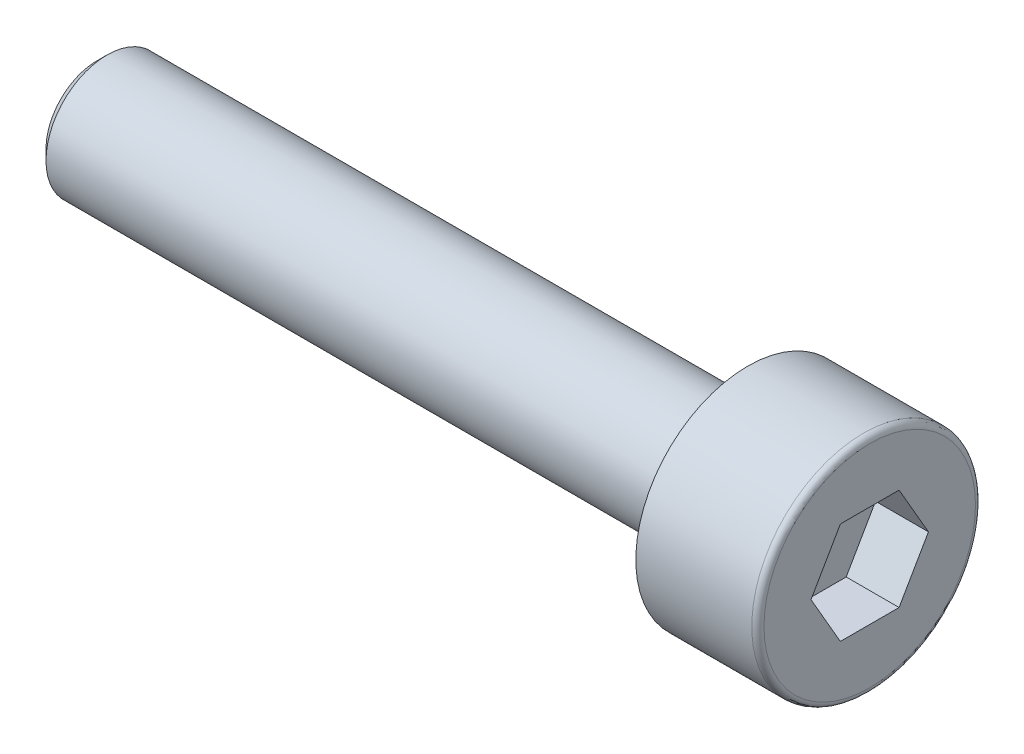
ISO-10303-21;
HEADER;
FILE_DESCRIPTION(('STEP AP214'),'2;1');
FILE_NAME('part.step','',(''),(''),'','','');
FILE_SCHEMA(('AUTOMOTIVE_DESIGN { 1 0 10303 214 1 1 1 1 }'));
ENDSEC;
DATA;
#1=APPLICATION_CONTEXT('core data for automotive mechanical design processes');
#2=APPLICATION_PROTOCOL_DEFINITION('international standard','automotive_design',2000,#1);
#3=PRODUCT_CONTEXT('',#1,'mechanical');
#4=PRODUCT('Part','Part','',(#3));
#5=PRODUCT_RELATED_PRODUCT_CATEGORY('part','',(#4));
#6=PRODUCT_DEFINITION_FORMATION('','',#4);
#7=PRODUCT_DEFINITION_CONTEXT('part definition',#1,'design');
#8=PRODUCT_DEFINITION('design','',#6,#7);
#9=PRODUCT_DEFINITION_SHAPE('','',#8);
#10=(LENGTH_UNIT() NAMED_UNIT(*) SI_UNIT(.MILLI.,.METRE.));
#11=(NAMED_UNIT(*) PLANE_ANGLE_UNIT() SI_UNIT($,.RADIAN.));
#12=(NAMED_UNIT(*) SI_UNIT($,.STERADIAN.) SOLID_ANGLE_UNIT());
#13=UNCERTAINTY_MEASURE_WITH_UNIT(LENGTH_MEASURE(1.E-05),#10,'distance_accuracy_value','');
#14=(GEOMETRIC_REPRESENTATION_CONTEXT(3) GLOBAL_UNCERTAINTY_ASSIGNED_CONTEXT((#13)) GLOBAL_UNIT_ASSIGNED_CONTEXT((#10,
#11,#12)) REPRESENTATION_CONTEXT('',''));
#15=CARTESIAN_POINT('',(0.,0.,0.));
#16=DIRECTION('',(0.,0.,1.));
#17=DIRECTION('',(1.,0.,0.));
#18=AXIS2_PLACEMENT_3D('',#15,#16,#17);
#19=CARTESIAN_POINT('',(0.,0.,0.));
#20=DIRECTION('',(1.,0.,0.));
#21=DIRECTION('',(0.,1.,0.));
#22=AXIS2_PLACEMENT_3D('',#19,#20,#21);
#23=PLANE('',#22);
#24=DIRECTION('',(0.,-0.866025403784439,0.5));
#25=VECTOR('',#24,1.);
#26=CARTESIAN_POINT('',(0.,1.25,0.721687836487035));
#27=LINE('',#26,#25);
#28=CARTESIAN_POINT('',(0.,1.25,0.721687836487035));
#29=VERTEX_POINT('',#28);
#30=CARTESIAN_POINT('',(0.,0.,1.44337567297407));
#31=VERTEX_POINT('',#30);
#32=EDGE_CURVE('E30',#29,#31,#27,.T.);
#33=ORIENTED_EDGE('',*,*,#32,.F.);
#34=DIRECTION('',(0.,0.,1.));
#35=VECTOR('',#34,1.);
#36=CARTESIAN_POINT('',(0.,1.25,-0.721687836487035));
#37=LINE('',#36,#35);
#38=CARTESIAN_POINT('',(0.,1.25,-0.721687836487035));
#39=VERTEX_POINT('',#38);
#40=EDGE_CURVE('E113',#39,#29,#37,.T.);
#41=ORIENTED_EDGE('',*,*,#40,.F.);
#42=DIRECTION('',(0.,0.866025403784439,0.5));
#43=VECTOR('',#42,1.);
#44=CARTESIAN_POINT('',(0.,0.,-1.44337567297406));
#45=LINE('',#44,#43);
#46=CARTESIAN_POINT('',(0.,0.,-1.44337567297406));
#47=VERTEX_POINT('',#46);
#48=EDGE_CURVE('E111',#47,#39,#45,.T.);
#49=ORIENTED_EDGE('',*,*,#48,.F.);
#50=DIRECTION('',(0.,0.866025403784439,-0.5));
#51=VECTOR('',#50,1.);
#52=CARTESIAN_POINT('',(0.,-1.25,-0.721687836487029));
#53=LINE('',#52,#51);
#54=CARTESIAN_POINT('',(0.,-1.25,-0.721687836487029));
#55=VERTEX_POINT('',#54);
#56=EDGE_CURVE('E78',#55,#47,#53,.T.);
#57=ORIENTED_EDGE('',*,*,#56,.F.);
#58=DIRECTION('',(0.,0.,-1.));
#59=VECTOR('',#58,1.);
#60=CARTESIAN_POINT('',(0.,-1.25,0.721687836487035));
#61=LINE('',#60,#59);
#62=CARTESIAN_POINT('',(0.,-1.25,0.721687836487035));
#63=VERTEX_POINT('',#62);
#64=EDGE_CURVE('E107',#63,#55,#61,.T.);
#65=ORIENTED_EDGE('',*,*,#64,.F.);
#66=DIRECTION('',(0.,-0.866025403784439,-0.5));
#67=VECTOR('',#66,1.);
#68=CARTESIAN_POINT('',(0.,0.,1.44337567297407));
#69=LINE('',#68,#67);
#70=EDGE_CURVE('E104',#31,#63,#69,.T.);
#71=ORIENTED_EDGE('',*,*,#70,.F.);
#72=EDGE_LOOP('',(#33,#41,#49,#57,#65,#71));
#73=FACE_BOUND('',#72,.T.);
#74=CARTESIAN_POINT('',(0.,0.,0.));
#75=DIRECTION('',(1.,0.,0.));
#76=DIRECTION('',(0.,1.,0.));
#77=AXIS2_PLACEMENT_3D('',#74,#75,#76);
#78=CIRCLE('',#77,2.6);
#79=CARTESIAN_POINT('',(0.,2.6,0.));
#80=VERTEX_POINT('',#79);
#81=EDGE_CURVE('E131',#80,#80,#78,.T.);
#82=ORIENTED_EDGE('',*,*,#81,.T.);
#83=EDGE_LOOP('',(#82));
#84=FACE_BOUND('',#83,.T.);
#85=ADVANCED_FACE('F15',(#73,#84),#23,.T.);
#86=CARTESIAN_POINT('',(-0.15,0.,0.));
#87=DIRECTION('',(1.,0.,0.));
#88=DIRECTION('',(0.,1.,0.));
#89=AXIS2_PLACEMENT_3D('',#86,#87,#88);
#90=TOROIDAL_SURFACE('',#89,2.6,0.15);
#91=CARTESIAN_POINT('',(-0.15,0.,0.));
#92=DIRECTION('',(1.,0.,0.));
#93=DIRECTION('',(0.,1.,0.));
#94=AXIS2_PLACEMENT_3D('',#91,#92,#93);
#95=CIRCLE('',#94,2.75);
#96=CARTESIAN_POINT('',(-0.15,2.75,0.));
#97=VERTEX_POINT('',#96);
#98=EDGE_CURVE('E128',#97,#97,#95,.T.);
#99=ORIENTED_EDGE('',*,*,#98,.T.);
#100=EDGE_LOOP('',(#99));
#101=FACE_BOUND('',#100,.T.);
#102=ORIENTED_EDGE('',*,*,#81,.F.);
#103=EDGE_LOOP('',(#102));
#104=FACE_BOUND('',#103,.T.);
#105=ADVANCED_FACE('F150',(#101,#104),#90,.T.);
#106=CARTESIAN_POINT('',(0.,0.,0.));
#107=DIRECTION('',(1.,0.,0.));
#108=DIRECTION('',(0.,1.,0.));
#109=AXIS2_PLACEMENT_3D('',#106,#107,#108);
#110=CYLINDRICAL_SURFACE('',#109,2.75);
#111=CARTESIAN_POINT('',(-3.,0.,0.));
#112=DIRECTION('',(1.,0.,0.));
#113=DIRECTION('',(0.,1.,0.));
#114=AXIS2_PLACEMENT_3D('',#111,#112,#113);
#115=CIRCLE('',#114,2.75);
#116=CARTESIAN_POINT('',(-3.,2.75,0.));
#117=VERTEX_POINT('',#116);
#118=EDGE_CURVE('E125',#117,#117,#115,.T.);
#119=ORIENTED_EDGE('',*,*,#118,.T.);
#120=EDGE_LOOP('',(#119));
#121=FACE_BOUND('',#120,.T.);
#122=ORIENTED_EDGE('',*,*,#98,.F.);
#123=EDGE_LOOP('',(#122));
#124=FACE_BOUND('',#123,.T.);
#125=ADVANCED_FACE('F156',(#121,#124),#110,.T.);
#126=CARTESIAN_POINT('',(-3.,2.75,0.));
#127=DIRECTION('',(-1.,0.,0.));
#128=DIRECTION('',(0.,-1.,0.));
#129=AXIS2_PLACEMENT_3D('',#126,#127,#128);
#130=PLANE('',#129);
#131=CARTESIAN_POINT('',(-3.,0.,0.));
#132=DIRECTION('',(1.,0.,0.));
#133=DIRECTION('',(0.,1.,0.));
#134=AXIS2_PLACEMENT_3D('',#131,#132,#133);
#135=CIRCLE('',#134,1.5);
#136=CARTESIAN_POINT('',(-3.,1.5,0.));
#137=VERTEX_POINT('',#136);
#138=EDGE_CURVE('E117',#137,#137,#135,.T.);
#139=ORIENTED_EDGE('',*,*,#138,.T.);
#140=EDGE_LOOP('',(#139));
#141=FACE_BOUND('',#140,.T.);
#142=ORIENTED_EDGE('',*,*,#118,.F.);
#143=EDGE_LOOP('',(#142));
#144=FACE_BOUND('',#143,.T.);
#145=ADVANCED_FACE('F163',(#141,#144),#130,.T.);
#146=CARTESIAN_POINT('',(0.,0.,0.));
#147=DIRECTION('',(1.,0.,0.));
#148=DIRECTION('',(0.,1.,0.));
#149=AXIS2_PLACEMENT_3D('',#146,#147,#148);
#150=CYLINDRICAL_SURFACE('',#149,1.5);
#151=CARTESIAN_POINT('',(-18.75,0.,0.));
#152=DIRECTION('',(-1.,0.,0.));
#153=DIRECTION('',(0.,-1.,0.));
#154=AXIS2_PLACEMENT_3D('',#151,#152,#153);
#155=CIRCLE('',#154,1.5);
#156=CARTESIAN_POINT('',(-18.75,-1.5,0.));
#157=VERTEX_POINT('',#156);
#158=EDGE_CURVE('E23',#157,#157,#155,.F.);
#159=ORIENTED_EDGE('',*,*,#158,.T.);
#160=EDGE_LOOP('',(#159));
#161=FACE_BOUND('',#160,.T.);
#162=ORIENTED_EDGE('',*,*,#138,.F.);
#163=EDGE_LOOP('',(#162));
#164=FACE_BOUND('',#163,.T.);
#165=ADVANCED_FACE('F136',(#161,#164),#150,.T.);
#166=CARTESIAN_POINT('',(-19.,1.5,0.));
#167=DIRECTION('',(-1.,0.,0.));
#168=DIRECTION('',(0.,-1.,0.));
#169=AXIS2_PLACEMENT_3D('',#166,#167,#168);
#170=PLANE('',#169);
#171=CARTESIAN_POINT('',(-19.,0.,0.));
#172=DIRECTION('',(-1.,0.,0.));
#173=DIRECTION('',(0.,-1.,0.));
#174=AXIS2_PLACEMENT_3D('',#171,#172,#173);
#175=CIRCLE('',#174,1.25);
#176=CARTESIAN_POINT('',(-19.,-1.25,0.));
#177=VERTEX_POINT('',#176);
#178=EDGE_CURVE('E9',#177,#177,#175,.T.);
#179=ORIENTED_EDGE('',*,*,#178,.T.);
#180=EDGE_LOOP('',(#179));
#181=FACE_BOUND('',#180,.T.);
#182=ADVANCED_FACE('F170',(#181),#170,.T.);
#183=CARTESIAN_POINT('',(-1.3,1.25,0.721687836487035));
#184=DIRECTION('',(0.,0.5,0.866025403784439));
#185=DIRECTION('',(0.,-0.866025403784439,0.5));
#186=AXIS2_PLACEMENT_3D('',#183,#184,#185);
#187=PLANE('',#186);
#188=ORIENTED_EDGE('',*,*,#32,.T.);
#189=DIRECTION('',(1.,0.,0.));
#190=VECTOR('',#189,1.);
#191=CARTESIAN_POINT('',(-1.3,0.,1.44337567297407));
#192=LINE('',#191,#190);
#193=CARTESIAN_POINT('',(-1.3,0.,1.44337567297407));
#194=VERTEX_POINT('',#193);
#195=EDGE_CURVE('E60',#194,#31,#192,.T.);
#196=ORIENTED_EDGE('',*,*,#195,.F.);
#197=DIRECTION('',(0.,-0.866025403784439,0.5));
#198=VECTOR('',#197,1.);
#199=CARTESIAN_POINT('',(-1.3,1.25,0.721687836487035));
#200=LINE('',#199,#198);
#201=CARTESIAN_POINT('',(-1.3,1.25,0.721687836487035));
#202=VERTEX_POINT('',#201);
#203=EDGE_CURVE('E115',#202,#194,#200,.T.);
#204=ORIENTED_EDGE('',*,*,#203,.F.);
#205=DIRECTION('',(1.,0.,0.));
#206=VECTOR('',#205,1.);
#207=CARTESIAN_POINT('',(-1.3,1.25,0.721687836487035));
#208=LINE('',#207,#206);
#209=EDGE_CURVE('E38',#202,#29,#208,.T.);
#210=ORIENTED_EDGE('',*,*,#209,.T.);
#211=EDGE_LOOP('',(#188,#196,#204,#210));
#212=FACE_BOUND('',#211,.T.);
#213=ADVANCED_FACE('F173',(#212),#187,.F.);
#214=CARTESIAN_POINT('',(-1.3,1.25,-0.721687836487035));
#215=DIRECTION('',(0.,1.,0.));
#216=DIRECTION('',(-1.,0.,0.));
#217=AXIS2_PLACEMENT_3D('',#214,#215,#216);
#218=PLANE('',#217);
#219=ORIENTED_EDGE('',*,*,#40,.T.);
#220=ORIENTED_EDGE('',*,*,#209,.F.);
#221=DIRECTION('',(0.,0.,1.));
#222=VECTOR('',#221,1.);
#223=CARTESIAN_POINT('',(-1.3,1.25,-0.721687836487035));
#224=LINE('',#223,#222);
#225=CARTESIAN_POINT('',(-1.3,1.25,-0.721687836487035));
#226=VERTEX_POINT('',#225);
#227=EDGE_CURVE('E90',#226,#202,#224,.T.);
#228=ORIENTED_EDGE('',*,*,#227,.F.);
#229=DIRECTION('',(1.,0.,0.));
#230=VECTOR('',#229,1.);
#231=CARTESIAN_POINT('',(-1.3,1.25,-0.721687836487035));
#232=LINE('',#231,#230);
#233=EDGE_CURVE('E82',#226,#39,#232,.T.);
#234=ORIENTED_EDGE('',*,*,#233,.T.);
#235=EDGE_LOOP('',(#219,#220,#228,#234));
#236=FACE_BOUND('',#235,.T.);
#237=ADVANCED_FACE('F177',(#236),#218,.F.);
#238=CARTESIAN_POINT('',(-1.3,0.,-1.44337567297406));
#239=DIRECTION('',(0.,0.5,-0.866025403784439));
#240=DIRECTION('',(0.,0.866025403784439,0.5));
#241=AXIS2_PLACEMENT_3D('',#238,#239,#240);
#242=PLANE('',#241);
#243=ORIENTED_EDGE('',*,*,#48,.T.);
#244=ORIENTED_EDGE('',*,*,#233,.F.);
#245=DIRECTION('',(0.,0.866025403784439,0.5));
#246=VECTOR('',#245,1.);
#247=CARTESIAN_POINT('',(-1.3,0.,-1.44337567297406));
#248=LINE('',#247,#246);
#249=CARTESIAN_POINT('',(-1.3,0.,-1.44337567297406));
#250=VERTEX_POINT('',#249);
#251=EDGE_CURVE('E86',#250,#226,#248,.T.);
#252=ORIENTED_EDGE('',*,*,#251,.F.);
#253=DIRECTION('',(1.,0.,0.));
#254=VECTOR('',#253,1.);
#255=CARTESIAN_POINT('',(-1.3,0.,-1.44337567297406));
#256=LINE('',#255,#254);
#257=EDGE_CURVE('E71',#250,#47,#256,.T.);
#258=ORIENTED_EDGE('',*,*,#257,.T.);
#259=EDGE_LOOP('',(#243,#244,#252,#258));
#260=FACE_BOUND('',#259,.T.);
#261=ADVANCED_FACE('F87',(#260),#242,.F.);
#262=CARTESIAN_POINT('',(-1.3,-1.25,-0.721687836487029));
#263=DIRECTION('',(0.,-0.5,-0.866025403784439));
#264=DIRECTION('',(0.,0.866025403784439,-0.5));
#265=AXIS2_PLACEMENT_3D('',#262,#263,#264);
#266=PLANE('',#265);
#267=ORIENTED_EDGE('',*,*,#56,.T.);
#268=ORIENTED_EDGE('',*,*,#257,.F.);
#269=DIRECTION('',(0.,0.866025403784439,-0.5));
#270=VECTOR('',#269,1.);
#271=CARTESIAN_POINT('',(-1.3,-1.25,-0.721687836487029));
#272=LINE('',#271,#270);
#273=CARTESIAN_POINT('',(-1.3,-1.25,-0.721687836487029));
#274=VERTEX_POINT('',#273);
#275=EDGE_CURVE('E75',#274,#250,#272,.T.);
#276=ORIENTED_EDGE('',*,*,#275,.F.);
#277=DIRECTION('',(1.,0.,0.));
#278=VECTOR('',#277,1.);
#279=CARTESIAN_POINT('',(-1.3,-1.25,-0.721687836487029));
#280=LINE('',#279,#278);
#281=EDGE_CURVE('E83',#274,#55,#280,.T.);
#282=ORIENTED_EDGE('',*,*,#281,.T.);
#283=EDGE_LOOP('',(#267,#268,#276,#282));
#284=FACE_BOUND('',#283,.T.);
#285=ADVANCED_FACE('F73',(#284),#266,.F.);
#286=CARTESIAN_POINT('',(-1.3,-1.25,0.721687836487035));
#287=DIRECTION('',(0.,-1.,0.));
#288=DIRECTION('',(0.,0.,-1.));
#289=AXIS2_PLACEMENT_3D('',#286,#287,#288);
#290=PLANE('',#289);
#291=ORIENTED_EDGE('',*,*,#64,.T.);
#292=ORIENTED_EDGE('',*,*,#281,.F.);
#293=DIRECTION('',(0.,0.,-1.));
#294=VECTOR('',#293,1.);
#295=CARTESIAN_POINT('',(-1.3,-1.25,0.721687836487035));
#296=LINE('',#295,#294);
#297=CARTESIAN_POINT('',(-1.3,-1.25,0.721687836487035));
#298=VERTEX_POINT('',#297);
#299=EDGE_CURVE('E96',#298,#274,#296,.T.);
#300=ORIENTED_EDGE('',*,*,#299,.F.);
#301=DIRECTION('',(1.,0.,0.));
#302=VECTOR('',#301,1.);
#303=CARTESIAN_POINT('',(-1.3,-1.25,0.721687836487035));
#304=LINE('',#303,#302);
#305=EDGE_CURVE('E120',#298,#63,#304,.T.);
#306=ORIENTED_EDGE('',*,*,#305,.T.);
#307=EDGE_LOOP('',(#291,#292,#300,#306));
#308=FACE_BOUND('',#307,.T.);
#309=ADVANCED_FACE('F180',(#308),#290,.F.);
#310=CARTESIAN_POINT('',(-1.3,0.,1.44337567297407));
#311=DIRECTION('',(0.,-0.5,0.866025403784439));
#312=DIRECTION('',(0.,-0.866025403784439,-0.5));
#313=AXIS2_PLACEMENT_3D('',#310,#311,#312);
#314=PLANE('',#313);
#315=ORIENTED_EDGE('',*,*,#70,.T.);
#316=ORIENTED_EDGE('',*,*,#305,.F.);
#317=DIRECTION('',(0.,-0.866025403784439,-0.5));
#318=VECTOR('',#317,1.);
#319=CARTESIAN_POINT('',(-1.3,0.,1.44337567297407));
#320=LINE('',#319,#318);
#321=EDGE_CURVE('E98',#194,#298,#320,.T.);
#322=ORIENTED_EDGE('',*,*,#321,.F.);
#323=ORIENTED_EDGE('',*,*,#195,.T.);
#324=EDGE_LOOP('',(#315,#316,#322,#323));
#325=FACE_BOUND('',#324,.T.);
#326=ADVANCED_FACE('F146',(#325),#314,.F.);
#327=CARTESIAN_POINT('',(-1.3,0.,1.44337567297407));
#328=DIRECTION('',(1.,0.,0.));
#329=DIRECTION('',(0.,1.,0.));
#330=AXIS2_PLACEMENT_3D('',#327,#328,#329);
#331=PLANE('',#330);
#332=ORIENTED_EDGE('',*,*,#203,.T.);
#333=ORIENTED_EDGE('',*,*,#321,.T.);
#334=ORIENTED_EDGE('',*,*,#299,.T.);
#335=ORIENTED_EDGE('',*,*,#275,.T.);
#336=ORIENTED_EDGE('',*,*,#251,.T.);
#337=ORIENTED_EDGE('',*,*,#227,.T.);
#338=EDGE_LOOP('',(#332,#333,#334,#335,#336,#337));
#339=FACE_BOUND('',#338,.T.);
#340=ADVANCED_FACE('F93',(#339),#331,.T.);
#341=CARTESIAN_POINT('',(-18.75,0.,0.));
#342=DIRECTION('',(1.,0.,0.));
#343=DIRECTION('',(0.,1.,0.));
#344=AXIS2_PLACEMENT_3D('',#341,#342,#343);
#345=CONICAL_SURFACE('',#344,1.5,0.785398163397445);
#346=ORIENTED_EDGE('',*,*,#178,.F.);
#347=EDGE_LOOP('',(#346));
#348=FACE_BOUND('',#347,.T.);
#349=ORIENTED_EDGE('',*,*,#158,.F.);
#350=EDGE_LOOP('',(#349));
#351=FACE_BOUND('',#350,.T.);
#352=ADVANCED_FACE('F17',(#348,#351),#345,.T.);
#353=CLOSED_SHELL('',(#85,#105,#125,#145,#165,#182,#213,#237,#261,#285,#309,#326,#340,#352));
#354=MANIFOLD_SOLID_BREP('B1',#353);
#355=ADVANCED_BREP_SHAPE_REPRESENTATION('',(#18,#354),#14);
#356=SHAPE_DEFINITION_REPRESENTATION(#9,#355);
ENDSEC;
END-ISO-10303-21;
